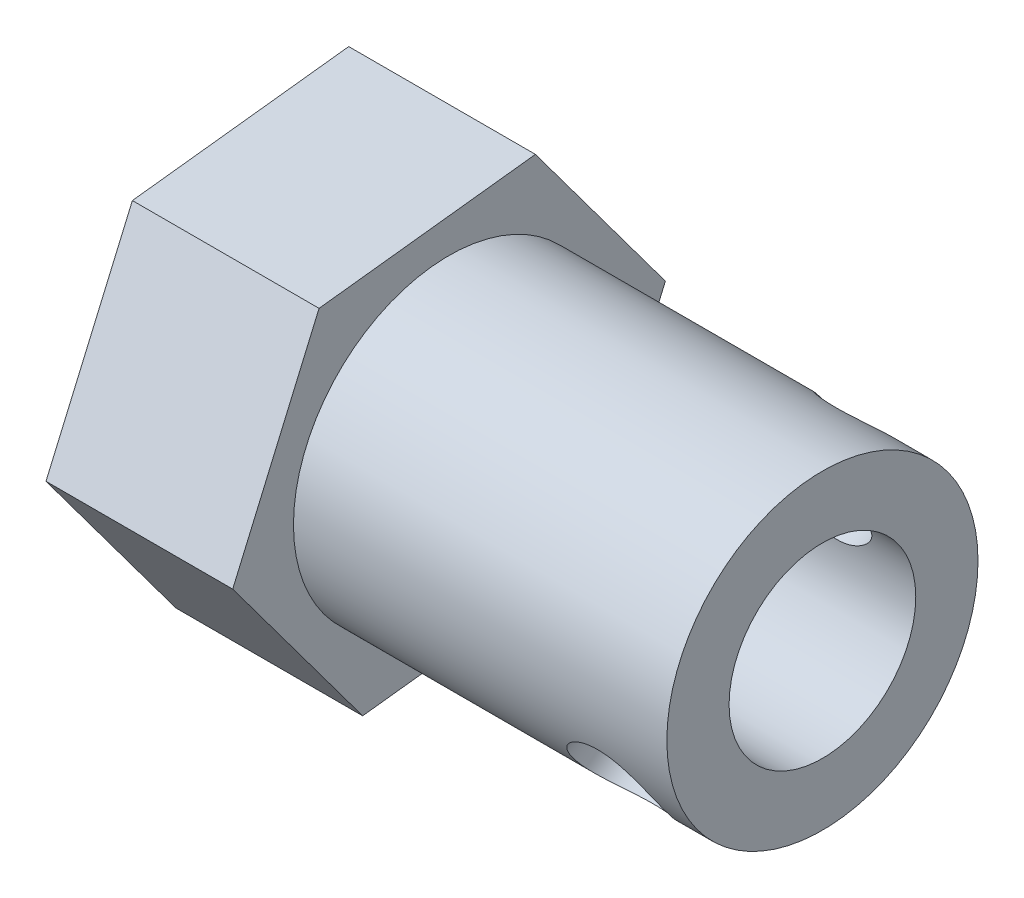
ISO-10303-21;
HEADER;
FILE_DESCRIPTION(('STEP AP214'),'2;1');
FILE_NAME('part.step','',(''),(''),'','','');
FILE_SCHEMA(('AUTOMOTIVE_DESIGN { 1 0 10303 214 1 1 1 1 }'));
ENDSEC;
DATA;
#1=APPLICATION_CONTEXT('core data for automotive mechanical design processes');
#2=APPLICATION_PROTOCOL_DEFINITION('international standard','automotive_design',2000,#1);
#3=PRODUCT_CONTEXT('',#1,'mechanical');
#4=PRODUCT('Part','Part','',(#3));
#5=PRODUCT_RELATED_PRODUCT_CATEGORY('part','',(#4));
#6=PRODUCT_DEFINITION_FORMATION('','',#4);
#7=PRODUCT_DEFINITION_CONTEXT('part definition',#1,'design');
#8=PRODUCT_DEFINITION('design','',#6,#7);
#9=PRODUCT_DEFINITION_SHAPE('','',#8);
#10=(LENGTH_UNIT() NAMED_UNIT(*) SI_UNIT(.MILLI.,.METRE.));
#11=(NAMED_UNIT(*) PLANE_ANGLE_UNIT() SI_UNIT($,.RADIAN.));
#12=(NAMED_UNIT(*) SI_UNIT($,.STERADIAN.) SOLID_ANGLE_UNIT());
#13=UNCERTAINTY_MEASURE_WITH_UNIT(LENGTH_MEASURE(1.E-05),#10,'distance_accuracy_value','');
#14=(GEOMETRIC_REPRESENTATION_CONTEXT(3) GLOBAL_UNCERTAINTY_ASSIGNED_CONTEXT((#13)) GLOBAL_UNIT_ASSIGNED_CONTEXT((#10,
#11,#12)) REPRESENTATION_CONTEXT('',''));
#15=CARTESIAN_POINT('',(0.,0.,0.));
#16=DIRECTION('',(0.,0.,1.));
#17=DIRECTION('',(1.,0.,0.));
#18=AXIS2_PLACEMENT_3D('',#15,#16,#17);
#19=CARTESIAN_POINT('',(18.,0.,0.));
#20=DIRECTION('',(-1.,0.,0.));
#21=DIRECTION('',(0.,0.,1.));
#22=AXIS2_PLACEMENT_3D('',#19,#20,#21);
#23=CYLINDRICAL_SURFACE('',#22,5.);
#24=CARTESIAN_POINT('',(15.5,-1.64276897045138,4.7224262947898));
#25=CARTESIAN_POINT('',(15.5821945479424,-1.64277029921527,4.72242636610456));
#26=CARTESIAN_POINT('',(15.664399224144,-1.64949026929,4.72010437132334));
#27=CARTESIAN_POINT('',(15.8264052495919,-1.67601147735562,4.71075127009213));
#28=CARTESIAN_POINT('',(15.9062057865015,-1.69581708616152,4.70371859018627));
#29=CARTESIAN_POINT('',(16.0610347282717,-1.74745877834305,4.6847771010607));
#30=CARTESIAN_POINT('',(16.1360708296331,-1.77927485088612,4.67287639979002));
#31=CARTESIAN_POINT('',(16.2796219339953,-1.85350013829668,4.64393345537745));
#32=CARTESIAN_POINT('',(16.3481359586844,-1.89591093892668,4.62689044248231));
#33=CARTESIAN_POINT('',(16.4788663905774,-1.9909848074739,4.58679737556888));
#34=CARTESIAN_POINT('',(16.5408458979463,-2.04390697104558,4.56358909338704));
#35=CARTESIAN_POINT('',(16.6546379513225,-2.15718857354355,4.51114485446022));
#36=CARTESIAN_POINT('',(16.7064491904499,-2.21754896684987,4.48190812389591));
#37=CARTESIAN_POINT('',(16.7994626998333,-2.34490155148806,4.41663372695534));
#38=CARTESIAN_POINT('',(16.8404234244428,-2.41200507273306,4.38046792310991));
#39=CARTESIAN_POINT('',(16.9089872590428,-2.54936279451714,4.30197579349803));
#40=CARTESIAN_POINT('',(16.9365932498574,-2.61961631197686,4.25965079892983));
#41=CARTESIAN_POINT('',(16.9768800010905,-2.75877378293411,4.17082521501291));
#42=CARTESIAN_POINT('',(16.9899651276527,-2.82765885236247,4.12447870991703));
#43=CARTESIAN_POINT('',(17.0021173246464,-2.96380791099536,4.02775489391073));
#44=CARTESIAN_POINT('',(17.001187339402,-3.03107223771493,3.97737843183404));
#45=CARTESIAN_POINT('',(16.985607131457,-3.159855668666,3.87580043072434));
#46=CARTESIAN_POINT('',(16.9713948061901,-3.22148952002128,3.82467626300841));
#47=CARTESIAN_POINT('',(16.9303686640057,-3.33982475077338,3.72179013134275));
#48=CARTESIAN_POINT('',(16.9035540490573,-3.39652581753568,3.67002812720464));
#49=CARTESIAN_POINT('',(16.8377879765814,-3.50449922796774,3.56708830083462));
#50=CARTESIAN_POINT('',(16.7986987971927,-3.55570065075604,3.51592430445788));
#51=CARTESIAN_POINT('',(16.7096021475718,-3.65114784311557,3.41670396990461));
#52=CARTESIAN_POINT('',(16.6595920870365,-3.69539195820646,3.36864837251445));
#53=CARTESIAN_POINT('',(16.5478022492484,-3.77800584928915,3.27577267667349));
#54=CARTESIAN_POINT('',(16.4856430809703,-3.81608343168597,3.23114871218397));
#55=CARTESIAN_POINT('',(16.3524899821099,-3.88388450436276,3.14932883936936));
#56=CARTESIAN_POINT('',(16.2814951746108,-3.91360716448032,3.11213366929091));
#57=CARTESIAN_POINT('',(16.131760530751,-3.96471344031146,3.04676759257289));
#58=CARTESIAN_POINT('',(16.0529529541371,-3.98601435847181,3.01868664127966));
#59=CARTESIAN_POINT('',(15.8903927915545,-4.01967461798792,2.97372055716426));
#60=CARTESIAN_POINT('',(15.8066418284654,-4.03203687637817,2.9568317720506));
#61=CARTESIAN_POINT('',(15.6399176392607,-4.04741010711791,2.93575141333068));
#62=CARTESIAN_POINT('',(15.557031776106,-4.05075245274062,2.93111004330223));
#63=CARTESIAN_POINT('',(15.3915270999901,-4.04900659406928,2.93352152086496));
#64=CARTESIAN_POINT('',(15.3089082512692,-4.04391956989446,2.94057273148461));
#65=CARTESIAN_POINT('',(15.1485116220291,-4.02561372970866,2.96557938787108));
#66=CARTESIAN_POINT('',(15.0706638357365,-4.01260960005549,2.98324679726664));
#67=CARTESIAN_POINT('',(14.9195983091851,-3.97877248283809,3.0282266004752));
#68=CARTESIAN_POINT('',(14.8463812858594,-3.95793828647507,3.05554048346301));
#69=CARTESIAN_POINT('',(14.7044825359279,-3.90793098028824,3.11925518082458));
#70=CARTESIAN_POINT('',(14.6359752790142,-3.87854906452534,3.15588020996342));
#71=CARTESIAN_POINT('',(14.5073618938192,-3.81190035588355,3.23606688855811));
#72=CARTESIAN_POINT('',(14.4472577823872,-3.77463167546919,3.27963019793058));
#73=CARTESIAN_POINT('',(14.3348195941853,-3.69095863392287,3.37356198219399));
#74=CARTESIAN_POINT('',(14.282864371013,-3.64426257131291,3.4241252381213));
#75=CARTESIAN_POINT('',(14.1910332989722,-3.54326452361577,3.52853283353583));
#76=CARTESIAN_POINT('',(14.1511568502185,-3.4889629164494,3.5823770099185));
#77=CARTESIAN_POINT('',(14.0849999694317,-3.37411410252843,3.69073609905309));
#78=CARTESIAN_POINT('',(14.058617983841,-3.31361778583776,3.74524274364645));
#79=CARTESIAN_POINT('',(14.0199390811096,-3.1874203768548,3.85321123160134));
#80=CARTESIAN_POINT('',(14.0076381340516,-3.12172077947148,3.90667336958744));
#81=CARTESIAN_POINT('',(13.9977769559455,-2.98956451117792,4.0086410584646));
#82=CARTESIAN_POINT('',(13.9996673045922,-2.92323442810004,4.05725820197074));
#83=CARTESIAN_POINT('',(14.0168216324991,-2.78943775484173,4.15038314804355));
#84=CARTESIAN_POINT('',(14.0320848534804,-2.72197122931348,4.19489118344989));
#85=CARTESIAN_POINT('',(14.0752116613996,-2.58874983960458,4.27837514666928));
#86=CARTESIAN_POINT('',(14.102938180649,-2.52298437470569,4.31740534805401));
#87=CARTESIAN_POINT('',(14.1700819145072,-2.39447045537869,4.38998450179249));
#88=CARTESIAN_POINT('',(14.2095010502862,-2.33172249871659,4.42353255198846));
#89=CARTESIAN_POINT('',(14.30037345743,-2.20929272682858,4.48596719117016));
#90=CARTESIAN_POINT('',(14.3521714300008,-2.14977326272395,4.51467027876052));
#91=CARTESIAN_POINT('',(14.4657103883328,-2.03809646030456,4.56617479135351));
#92=CARTESIAN_POINT('',(14.5274542378981,-1.98594125058577,4.58897451160252));
#93=CARTESIAN_POINT('',(14.6613407783105,-1.88952228865807,4.62952781052553));
#94=CARTESIAN_POINT('',(14.7337385533904,-1.84554006653804,4.64711073873539));
#95=CARTESIAN_POINT('',(14.885555174161,-1.76941804472663,4.67662659471387));
#96=CARTESIAN_POINT('',(14.9649706236012,-1.73727255506927,4.68856223794391));
#97=CARTESIAN_POINT('',(15.1197404316063,-1.68916904212102,4.70609083831169));
#98=CARTESIAN_POINT('',(15.194608646931,-1.6718388206725,4.71222913894122));
#99=CARTESIAN_POINT('',(15.3463152224958,-1.64863931248333,4.72039642193846));
#100=CARTESIAN_POINT('',(15.4231531846452,-1.64276772813937,4.72242622811491));
#101=CARTESIAN_POINT('',(15.5,-1.64276897045138,4.7224262947898));
#102=B_SPLINE_CURVE_WITH_KNOTS('',3,(#24,#25,#26,#27,#28,#29,#30,#31,#32,#33,#34,#35,#36,#37,
#38,#39,#40,#41,#42,#43,#44,#45,#46,#47,#48,#49,#50,#51,#52,#53,#54,#55,#56,#57,#58,#59,#60,#61,
#62,#63,#64,#65,#66,#67,#68,#69,#70,#71,#72,#73,#74,#75,#76,#77,#78,#79,#80,#81,#82,#83,#84,#85,
#86,#87,#88,#89,#90,#91,#92,#93,#94,#95,#96,#97,#98,#99,#100,#101),.UNSPECIFIED.,.T.,.F.,(4,2,2,
2,2,2,2,2,2,2,2,2,2,2,2,2,2,2,2,2,2,2,2,2,2,2,2,2,2,2,2,2,2,2,2,2,2,2,4),(0.,0.246300165915547,
0.492682641688999,0.738656414466189,0.984667025370101,1.23773150007984,1.49082847871273,
1.74915939273644,2.00743455587877,2.25832140149557,2.5091555410144,2.7520012599088,
2.99486235890376,3.24055209335676,3.4863001659083,3.74152147023277,3.99676812491863,
4.25446238246266,4.51207250628411,4.76008080790309,5.00805439107387,5.24958594938817,
5.49115481045787,5.73920731809388,5.98731925928922,6.24479506100602,6.50225807324202,
6.75775391814325,7.01317662321682,7.2587630391122,7.50433553047754,7.74727096872218,
7.99024634491378,8.24099627054488,8.4918185262989,8.75011639669147,9.00828993963944,
9.23861153857447,9.46888695033559),.UNSPECIFIED.);
#103=CARTESIAN_POINT('',(15.5,-1.64276897045138,4.7224262947898));
#104=VERTEX_POINT('',#103);
#105=EDGE_CURVE('E182',#104,#104,#102,.T.);
#106=ORIENTED_EDGE('',*,*,#105,.T.);
#107=EDGE_LOOP('',(#106));
#108=FACE_BOUND('',#107,.T.);
#109=CARTESIAN_POINT('',(15.5,4.05001509681142,-2.93212852985669));
#110=CARTESIAN_POINT('',(15.4178054520576,4.05001478277048,-2.93212982294507));
#111=CARTESIAN_POINT('',(15.335600775856,4.04585737905846,-2.93789746127844));
#112=CARTESIAN_POINT('',(15.1735947504081,4.02926860088876,-2.96060577294483));
#113=CARTESIAN_POINT('',(15.0937942134985,4.01683446185724,-2.97755017949611));
#114=CARTESIAN_POINT('',(14.9389652717283,3.98383461505443,-3.0215576162842));
#115=CARTESIAN_POINT('',(14.8639291703669,3.9632824302676,-3.04860381496883));
#116=CARTESIAN_POINT('',(14.7203780660047,3.91420588337461,-3.11136192095928));
#117=CARTESIAN_POINT('',(14.6518640413156,3.88568032778066,-3.14707512547355));
#118=CARTESIAN_POINT('',(14.5211336094226,3.81992622713394,-3.22659174476284));
#119=CARTESIAN_POINT('',(14.4591541020537,3.78247159324638,-3.27059776888783));
#120=CARTESIAN_POINT('',(14.3453620486775,3.69964956342205,-3.36399814917024));
#121=CARTESIAN_POINT('',(14.2935508095501,3.65428115177793,-3.4133931966859));
#122=CARTESIAN_POINT('',(14.2005373001667,3.55512277646983,-3.51657771256032));
#123=CARTESIAN_POINT('',(14.1595765755572,3.50117806032178,-3.57043693211436));
#124=CARTESIAN_POINT('',(14.0910127409572,3.38648206583668,-3.67940016900551));
#125=CARTESIAN_POINT('',(14.0634067501425,3.32573225894909,-3.73450391519197));
#126=CARTESIAN_POINT('',(14.0231199989095,3.20062196809416,-3.84221742968108));
#127=CARTESIAN_POINT('',(14.0100348723473,3.13641448561348,-3.8948534488908));
#128=CARTESIAN_POINT('',(13.9978826753536,3.00460563549238,-3.99741313775145));
#129=CARTESIAN_POINT('',(13.998812660598,2.93700498367019,-4.0473373748875));
#130=CARTESIAN_POINT('',(14.014392868543,2.80266663228918,-4.14144619352424));
#131=CARTESIAN_POINT('',(14.0286051938099,2.73597001444591,-4.18576293218809));
#132=CARTESIAN_POINT('',(14.0696313359943,2.60338522978141,-4.26948902012813));
#133=CARTESIAN_POINT('',(14.0964459509427,2.53749711442918,-4.30889805842784));
#134=CARTESIAN_POINT('',(14.1622120234186,2.40784242508932,-4.38268509486111));
#135=CARTESIAN_POINT('',(14.2013012028073,2.34410949907407,-4.41699914974129));
#136=CARTESIAN_POINT('',(14.2903978524282,2.22162130280697,-4.47985997294153));
#137=CARTESIAN_POINT('',(14.3404079129635,2.16286721807398,-4.50840536990654));
#138=CARTESIAN_POINT('',(14.4521977507516,2.0501480002441,-4.5608012457899));
#139=CARTESIAN_POINT('',(14.5143569190297,1.99645478230935,-4.58442832423307));
#140=CARTESIAN_POINT('',(14.6475100178901,1.89858607122715,-4.62581905308184));
#141=CARTESIAN_POINT('',(14.7185048253892,1.8544115239763,-4.64358212085774));
#142=CARTESIAN_POINT('',(14.868239469249,1.77710452537862,-4.67371853376062));
#143=CARTESIAN_POINT('',(14.9470470458629,1.74408202047968,-4.68603856258388));
#144=CARTESIAN_POINT('',(15.1096072084455,1.69133219606558,-4.70533669243229));
#145=CARTESIAN_POINT('',(15.1933581715346,1.67160053937049,-4.71231653621206));
#146=CARTESIAN_POINT('',(15.3600823607393,1.64698819803166,-4.72097392617432));
#147=CARTESIAN_POINT('',(15.442968223894,1.64158138998633,-4.72283940647805));
#148=CARTESIAN_POINT('',(15.6084729000099,1.64439323696076,-4.72186126378488));
#149=CARTESIAN_POINT('',(15.6910917487308,1.65260998467076,-4.71901829997435));
#150=CARTESIAN_POINT('',(15.8514883779709,1.68182640547355,-4.70868208190323));
#151=CARTESIAN_POINT('',(15.9293361642635,1.70248844970298,-4.70131155471397));
#152=CARTESIAN_POINT('',(16.0804016908149,1.75530230219526,-4.68184799432053));
#153=CARTESIAN_POINT('',(16.1536187141406,1.787455884474,-4.66975423193618));
#154=CARTESIAN_POINT('',(16.2955174640721,1.86286512487097,-4.64019514205351));
#155=CARTESIAN_POINT('',(16.3640247209858,1.90639559733367,-4.62259435512527));
#156=CARTESIAN_POINT('',(16.4926381061808,2.00236860252298,-4.58183731815496));
#157=CARTESIAN_POINT('',(16.5527422176128,2.05481326808662,-4.55867973803038));
#158=CARTESIAN_POINT('',(16.6651804058147,2.16884867144185,-4.50557338475575));
#159=CARTESIAN_POINT('',(16.717135628987,2.23070988708599,-4.47540129314325));
#160=CARTESIAN_POINT('',(16.8089667010277,2.3597631740868,-4.40871695665284));
#161=CARTESIAN_POINT('',(16.8488431497815,2.42695498049362,-4.37220502678099));
#162=CARTESIAN_POINT('',(16.9150000305683,2.56377807735289,-4.29339270272585));
#163=CARTESIAN_POINT('',(16.941382016159,2.63338680616999,-4.25113866729215));
#164=CARTESIAN_POINT('',(16.9800609188904,2.77310127564768,-4.16134530760536));
#165=CARTESIAN_POINT('',(16.9923618659484,2.84320686832627,-4.1138074998145));
#166=CARTESIAN_POINT('',(17.0022230440545,2.97888893006713,-4.01658061595012));
#167=CARTESIAN_POINT('',(17.0003326954078,3.04453584781037,-3.96704488385067));
#168=CARTESIAN_POINT('',(16.9831783675009,3.17222115290468,-3.86570255202913));
#169=CARTESIAN_POINT('',(16.9679151465196,3.23425974464515,-3.81389608122244));
#170=CARTESIAN_POINT('',(16.9247883386004,3.35254626783113,-3.7103305984429));
#171=CARTESIAN_POINT('',(16.897061819351,3.40884922778671,-3.6585770507989));
#172=CARTESIAN_POINT('',(16.8299180854928,3.51533759277852,-3.55638219212415));
#173=CARTESIAN_POINT('',(16.7904989497138,3.56552199058313,-3.50594109822038));
#174=CARTESIAN_POINT('',(16.69962654257,3.66054421188822,-3.40665408661994));
#175=CARTESIAN_POINT('',(16.6478285699992,3.7051595795261,-3.35791085308892));
#176=CARTESIAN_POINT('',(16.5342896116672,3.78661985906874,-3.26577700549264));
#177=CARTESIAN_POINT('',(16.4725457621018,3.82346252583277,-3.22238793947413));
#178=CARTESIAN_POINT('',(16.3386592216895,3.89004443283488,-3.1417155406458));
#179=CARTESIAN_POINT('',(16.2662614466096,3.91953923199412,-3.10465272842648));
#180=CARTESIAN_POINT('',(16.114444825839,3.96971022905595,-3.0402429542255));
#181=CARTESIAN_POINT('',(16.0350293763988,3.99039066481424,-3.01289132426542));
#182=CARTESIAN_POINT('',(15.8802595683937,4.02101929755458,-2.97186588526383));
#183=CARTESIAN_POINT('',(15.805391353069,4.03188461201727,-2.95703482826507));
#184=CARTESIAN_POINT('',(15.6536847775042,4.04638193340869,-2.93716652777786));
#185=CARTESIAN_POINT('',(15.5768468153547,4.05001539042027,-2.93212732089908));
#186=CARTESIAN_POINT('',(15.5,4.05001509681142,-2.93212852985669));
#187=B_SPLINE_CURVE_WITH_KNOTS('',3,(#109,#110,#111,#112,#113,#114,#115,#116,#117,#118,#119,
#120,#121,#122,#123,#124,#125,#126,#127,#128,#129,#130,#131,#132,#133,#134,#135,#136,#137,#138,
#139,#140,#141,#142,#143,#144,#145,#146,#147,#148,#149,#150,#151,#152,#153,#154,#155,#156,#157,
#158,#159,#160,#161,#162,#163,#164,#165,#166,#167,#168,#169,#170,#171,#172,#173,#174,#175,#176,
#177,#178,#179,#180,#181,#182,#183,#184,#185,#186),.UNSPECIFIED.,.T.,.F.,(4,2,2,2,2,2,2,2,2,2,2,
2,2,2,2,2,2,2,2,2,2,2,2,2,2,2,2,2,2,2,2,2,2,2,2,2,2,2,4),(0.,0.246300165915542,
0.492682641689001,0.738656414466195,0.984667025370102,1.23773150007984,1.49082847871273,
1.74915939273645,2.00743455587877,2.25832140149558,2.5091555410144,2.7520012599088,
2.99486235890376,3.24055209335676,3.4863001659083,3.74152147023278,3.99676812491863,
4.25446238246266,4.51207250628411,4.76008080790309,5.00805439107387,5.24958594938816,
5.49115481045787,5.73920731809388,5.98731925928922,6.24479506100601,6.50225807324202,
6.75775391814325,7.01317662321682,7.2587630391122,7.50433553047754,7.74727096872219,
7.99024634491378,8.24099627054488,8.4918185262989,8.75011639669147,9.00828993963944,
9.23861153857447,9.46888695033559),.UNSPECIFIED.);
#188=CARTESIAN_POINT('',(15.5,4.05001509681142,-2.93212852985669));
#189=VERTEX_POINT('',#188);
#190=EDGE_CURVE('E178',#189,#189,#187,.T.);
#191=ORIENTED_EDGE('',*,*,#190,.T.);
#192=EDGE_LOOP('',(#191));
#193=FACE_BOUND('',#192,.T.);
#194=CARTESIAN_POINT('',(18.,0.,0.));
#195=DIRECTION('',(1.,0.,0.));
#196=DIRECTION('',(0.,0.,-1.));
#197=AXIS2_PLACEMENT_3D('',#194,#195,#196);
#198=CIRCLE('',#197,5.);
#199=CARTESIAN_POINT('',(18.,0.,-5.));
#200=VERTEX_POINT('',#199);
#201=EDGE_CURVE('E47',#200,#200,#198,.T.);
#202=ORIENTED_EDGE('',*,*,#201,.F.);
#203=EDGE_LOOP('',(#202));
#204=FACE_BOUND('',#203,.T.);
#205=CARTESIAN_POINT('',(6.,0.,0.));
#206=DIRECTION('',(-1.,0.,0.));
#207=DIRECTION('',(0.,0.,1.));
#208=AXIS2_PLACEMENT_3D('',#205,#206,#207);
#209=CIRCLE('',#208,5.);
#210=CARTESIAN_POINT('',(6.,0.,5.));
#211=VERTEX_POINT('',#210);
#212=EDGE_CURVE('E11',#211,#211,#209,.T.);
#213=ORIENTED_EDGE('',*,*,#212,.F.);
#214=EDGE_LOOP('',(#213));
#215=FACE_BOUND('',#214,.T.);
#216=ADVANCED_FACE('F33',(#108,#193,#204,#215),#23,.T.);
#217=CARTESIAN_POINT('',(18.,0.,0.));
#218=DIRECTION('',(-1.,0.,0.));
#219=DIRECTION('',(0.,0.,1.));
#220=AXIS2_PLACEMENT_3D('',#217,#218,#219);
#221=CYLINDRICAL_SURFACE('',#220,3.);
#222=CARTESIAN_POINT('',(15.5,-0.346820281590558,2.97988518105605));
#223=CARTESIAN_POINT('',(15.5781617122929,-0.346828722799379,2.97988738957281));
#224=CARTESIAN_POINT('',(15.6564221172876,-0.353892074644911,2.97908833860227));
#225=CARTESIAN_POINT('',(15.8105408970157,-0.381585323771733,2.97566379259017));
#226=CARTESIAN_POINT('',(15.8863938725651,-0.402243728186108,2.97303445900312));
#227=CARTESIAN_POINT('',(16.0331774965159,-0.455458313208438,2.96534472271822));
#228=CARTESIAN_POINT('',(16.1041319787104,-0.487951219420663,2.96029720465122));
#229=CARTESIAN_POINT('',(16.2401363029951,-0.562972214328329,2.94694918896967));
#230=CARTESIAN_POINT('',(16.3051858253937,-0.605500845904872,2.93864851536009));
#231=CARTESIAN_POINT('',(16.4334585928363,-0.7026031720525,2.91702212836963));
#232=CARTESIAN_POINT('',(16.4960887035103,-0.757881012969705,2.90333842625017));
#233=CARTESIAN_POINT('',(16.6121125826101,-0.875865888567804,2.86995102288071));
#234=CARTESIAN_POINT('',(16.6655017438753,-0.938576602877878,2.85024433227781));
#235=CARTESIAN_POINT('',(16.7650507267215,-1.07370329440105,2.80225514991906));
#236=CARTESIAN_POINT('',(16.8104806517893,-1.1464885357062,2.77348412890245));
#237=CARTESIAN_POINT('',(16.8877112798686,-1.29525134184175,2.70720071819451));
#238=CARTESIAN_POINT('',(16.9195205842058,-1.37122685864719,2.66969386829322));
#239=CARTESIAN_POINT('',(16.9662569919516,-1.51783230295303,2.58895378757728));
#240=CARTESIAN_POINT('',(16.9822242895333,-1.58845793243876,2.54631790936692));
#241=CARTESIAN_POINT('',(17.0002491780126,-1.72709043049983,2.45439594680983));
#242=CARTESIAN_POINT('',(17.0023151851936,-1.79509885880679,2.4051139047029));
#243=CARTESIAN_POINT('',(16.9928799890445,-1.92037305969069,2.30607686054614));
#244=CARTESIAN_POINT('',(16.9825429767182,-1.97805873025616,2.25673566652595));
#245=CARTESIAN_POINT('',(16.950678734143,-2.0878608760252,2.15555373421476));
#246=CARTESIAN_POINT('',(16.9291506665357,-2.13997693413675,2.10371280914747));
#247=CARTESIAN_POINT('',(16.8753761508653,-2.2384662999785,1.99863237145997));
#248=CARTESIAN_POINT('',(16.8429855302419,-2.28475017824807,1.94538343212415));
#249=CARTESIAN_POINT('',(16.7686048756978,-2.37040292377309,1.84005572362338));
#250=CARTESIAN_POINT('',(16.7266114050465,-2.40976930640863,1.78797738074549));
#251=CARTESIAN_POINT('',(16.6296569727005,-2.4850387300265,1.68202096972489));
#252=CARTESIAN_POINT('',(16.573845457511,-2.52026263485667,1.62843812054107));
#253=CARTESIAN_POINT('',(16.4531154126047,-2.58287084182277,1.52719632235496));
#254=CARTESIAN_POINT('',(16.3881899415889,-2.61024911984066,1.47954194121785));
#255=CARTESIAN_POINT('',(16.2460277113639,-2.65911507442412,1.38991988109648));
#256=CARTESIAN_POINT('',(16.1682709654187,-2.6801182656378,1.34850550731285));
#257=CARTESIAN_POINT('',(16.0055934929615,-2.71422351246084,1.27848454752816));
#258=CARTESIAN_POINT('',(15.9206803504737,-2.72733381549652,1.24986460047296));
#259=CARTESIAN_POINT('',(15.7531782330758,-2.74525633313137,1.20996449116616));
#260=CARTESIAN_POINT('',(15.6709383214347,-2.75064380392767,1.19748995639357));
#261=CARTESIAN_POINT('',(15.5053979877252,-2.75511201562196,1.18718042840319));
#262=CARTESIAN_POINT('',(15.4220983563203,-2.75419721148103,1.18933509405979));
#263=CARTESIAN_POINT('',(15.2665191221319,-2.74650271297132,1.20697565740996));
#264=CARTESIAN_POINT('',(15.1940308233381,-2.74037553170583,1.22097745474551));
#265=CARTESIAN_POINT('',(15.0524483205936,-2.72302116005645,1.25920330285426));
#266=CARTESIAN_POINT('',(14.9833552238801,-2.71179231800019,1.28343066399264));
#267=CARTESIAN_POINT('',(14.846883003646,-2.68340882924956,1.34179431376273));
#268=CARTESIAN_POINT('',(14.7797314747197,-2.6660038146097,1.37633756642439));
#269=CARTESIAN_POINT('',(14.6517960926915,-2.62510663508081,1.45282312331235));
#270=CARTESIAN_POINT('',(14.5910155347301,-2.601611341833,1.49476922657437));
#271=CARTESIAN_POINT('',(14.4695318487147,-2.54480016009455,1.58978753763877));
#272=CARTESIAN_POINT('',(14.4098042739235,-2.51061967394402,1.64359572864554));
#273=CARTESIAN_POINT('',(14.3008816430096,-2.43362693997363,1.75558438184282));
#274=CARTESIAN_POINT('',(14.2516901446542,-2.39081178588997,1.81376631200332));
#275=CARTESIAN_POINT('',(14.1641394110748,-2.29512886053609,1.93349452549732));
#276=CARTESIAN_POINT('',(14.1261003226836,-2.24202560411368,1.99508907489065));
#277=CARTESIAN_POINT('',(14.0642931442139,-2.12704817427302,2.11723318403221));
#278=CARTESIAN_POINT('',(14.0405125229505,-2.06518176173527,2.17778361581518));
#279=CARTESIAN_POINT('',(14.009947153738,-1.94015714234711,2.28957845741998));
#280=CARTESIAN_POINT('',(14.0018031861858,-1.8776382879691,2.3411669724385));
#281=CARTESIAN_POINT('',(13.9987351018184,-1.74839644770748,2.43919620434149));
#282=CARTESIAN_POINT('',(14.0038063572147,-1.68167494151942,2.48563871734686));
#283=CARTESIAN_POINT('',(14.0261246101934,-1.55080232857267,2.56917254421401));
#284=CARTESIAN_POINT('',(14.0425472738865,-1.48677155690616,2.6066783932279));
#285=CARTESIAN_POINT('',(14.0859904989545,-1.3590050921156,2.67551388509055));
#286=CARTESIAN_POINT('',(14.1130125801402,-1.29526944263463,2.70684264126063));
#287=CARTESIAN_POINT('',(14.178090578249,-1.16727582090258,2.76452645102217));
#288=CARTESIAN_POINT('',(14.2165689848118,-1.10311210063758,2.79061146766139));
#289=CARTESIAN_POINT('',(14.3029368962886,-0.979021985901599,2.83652969400639));
#290=CARTESIAN_POINT('',(14.3508307236735,-0.919097554868439,2.85636002135218));
#291=CARTESIAN_POINT('',(14.4601957085341,-0.799592801825004,2.89221703505733));
#292=CARTESIAN_POINT('',(14.5225437312158,-0.740640233394047,2.90766877736979));
#293=CARTESIAN_POINT('',(14.6561760816947,-0.632337347337203,2.93313018988352));
#294=CARTESIAN_POINT('',(14.7274682313015,-0.582995532100613,2.94313505528871));
#295=CARTESIAN_POINT('',(14.8799549698714,-0.495138386489574,2.95920596321727));
#296=CARTESIAN_POINT('',(14.9613912966931,-0.457014470321811,2.96513753978529));
#297=CARTESIAN_POINT('',(15.1299986065097,-0.396740437873087,2.97381037908972));
#298=CARTESIAN_POINT('',(15.217149333369,-0.374536909149205,2.97656232856685));
#299=CARTESIAN_POINT('',(15.337708033478,-0.356502280516354,2.97874486225514));
#300=CARTESIAN_POINT('',(15.3700518415968,-0.352879307053495,2.979174705898));
#301=CARTESIAN_POINT('',(15.4349247210234,-0.348036469767949,2.97974441518953));
#302=CARTESIAN_POINT('',(15.4674538045788,-0.346816766708094,2.97988426143932));
#303=CARTESIAN_POINT('',(15.5,-0.346820281590558,2.97988518105605));
#304=B_SPLINE_CURVE_WITH_KNOTS('',3,(#222,#223,#224,#225,#226,#227,#228,#229,#230,#231,#232,
#233,#234,#235,#236,#237,#238,#239,#240,#241,#242,#243,#244,#245,#246,#247,#248,#249,#250,#251,
#252,#253,#254,#255,#256,#257,#258,#259,#260,#261,#262,#263,#264,#265,#266,#267,#268,#269,#270,
#271,#272,#273,#274,#275,#276,#277,#278,#279,#280,#281,#282,#283,#284,#285,#286,#287,#288,#289,
#290,#291,#292,#293,#294,#295,#296,#297,#298,#299,#300,#301,#302,#303),.UNSPECIFIED.,.T.,.F.,(4,
2,2,2,2,2,2,2,2,2,2,2,2,2,2,2,2,2,2,2,2,2,2,2,2,2,2,2,2,2,2,2,2,2,2,2,2,2,2,2,4),(0.,
0.234348183892077,0.469189339237209,0.70279289387833,0.93640908816773,1.18929346874735,
1.44230356626556,1.71236838358145,1.98226240445837,2.23295227451903,2.4834903552906,
2.71224146226808,2.94100968776183,3.1729430209672,3.40495949025408,3.65890787185336,
3.91305072368878,4.18333262594172,4.45333161317557,4.70193436281317,4.95036139782559,
5.17161275136038,5.39293578654094,5.62450944609131,5.85620229330071,6.11710115370919,
6.37808797467303,6.64596272119448,6.91360169713157,7.1566840558423,7.39968130190957,
7.62666637307239,7.85368400268019,8.09041126079207,8.32724745151078,8.58765362775101,
8.84828914267731,9.11716123557907,9.3851269950414,9.48270202777963,9.5802835874181),.UNSPECIFIED.);
#305=CARTESIAN_POINT('',(15.5,-0.346820281590558,2.97988518105605));
#306=VERTEX_POINT('',#305);
#307=EDGE_CURVE('E37',#306,#306,#304,.T.);
#308=ORIENTED_EDGE('',*,*,#307,.F.);
#309=EDGE_LOOP('',(#308));
#310=FACE_BOUND('',#309,.T.);
#311=CARTESIAN_POINT('',(15.5,2.75406640795061,-1.18958741612294));
#312=CARTESIAN_POINT('',(15.4218382877071,2.75406609418468,-1.18959613581924));
#313=CARTESIAN_POINT('',(15.3435778827124,2.75126842143453,-1.19613084690164));
#314=CARTESIAN_POINT('',(15.1894591029843,2.74002022570385,-1.22166751965659));
#315=CARTESIAN_POINT('',(15.1136061274349,2.73155782384917,-1.24069567834075));
#316=CARTESIAN_POINT('',(14.9668225034841,2.7088812886019,-1.28944707680694));
#317=CARTESIAN_POINT('',(14.8958680212896,2.6946977015569,-1.31911342560975));
#318=CARTESIAN_POINT('',(14.7598636970049,2.6603275898139,-1.38712088562955));
#319=CARTESIAN_POINT('',(14.6948141746063,2.64014074035492,-1.42546246612732));
#320=CARTESIAN_POINT('',(14.5665414071637,2.59148866222979,-1.51223537463941));
#321=CARTESIAN_POINT('',(14.5039112964897,2.56247797309471,-1.56123806146442));
#322=CARTESIAN_POINT('',(14.3878874173899,2.49655350900488,-1.66462623587582));
#323=CARTESIAN_POINT('',(14.3344982561247,2.45963581234233,-1.71901438731462));
#324=CARTESIAN_POINT('',(14.2349492732785,2.37479470226875,-1.83461789256833));
#325=CARTESIAN_POINT('',(14.1895193482107,2.32629716795793,-1.89604632383559));
#326=CARTESIAN_POINT('',(14.1122887201314,2.2200118560374,-2.01944525209008));
#327=CARTESIAN_POINT('',(14.0804794157942,2.16222997323108,-2.08141538169079));
#328=CARTESIAN_POINT('',(14.0337430080484,2.04272014959123,-2.19858841181164));
#329=CARTESIAN_POINT('',(14.0177757104667,1.98156553502062,-2.25395907884522));
#330=CARTESIAN_POINT('',(13.9997508219874,1.85364087279303,-2.36027886775095));
#331=CARTESIAN_POINT('',(13.9976848148064,1.78687424762414,-2.41123064650861));
#332=CARTESIAN_POINT('',(14.0071200109555,1.65597914072326,-2.50270978353894));
#333=CARTESIAN_POINT('',(14.0174570232818,1.59212614456443,-2.54375835108356));
#334=CARTESIAN_POINT('',(14.049321265857,1.463628803063,-2.61980260049651));
#335=CARTESIAN_POINT('',(14.0708493334643,1.39898439885764,-2.65479782916918));
#336=CARTESIAN_POINT('',(14.1246238491347,1.27000857552442,-2.71888597599855));
#337=CARTESIAN_POINT('',(14.1570144697581,1.20569386086352,-2.747890534367));
#338=CARTESIAN_POINT('',(14.2313951243022,1.08017484451127,-2.7996137934287));
#339=CARTESIAN_POINT('',(14.2733885949535,1.01897166600528,-2.82233023724104));
#340=CARTESIAN_POINT('',(14.3703430272995,0.895838242104379,-2.86392839929865));
#341=CARTESIAN_POINT('',(14.426154542489,0.834386145584283,-2.88224464977264));
#342=CARTESIAN_POINT('',(14.5468845873953,0.719411095025042,-2.91307364632404));
#343=CARTESIAN_POINT('',(14.6118100584111,0.665894249053259,-2.92558193741509));
#344=CARTESIAN_POINT('',(14.7539722886361,0.566001725757253,-2.94659333830386));
#345=CARTESIAN_POINT('',(14.8317290345813,0.520295359653717,-2.95479166097735));
#346=CARTESIAN_POINT('',(14.9944065070385,0.443422231767221,-2.96730664715296));
#347=CARTESIAN_POINT('',(15.0793196495263,0.412240300870162,-2.9716273647624));
#348=CARTESIAN_POINT('',(15.2468217669242,0.36887059412204,-2.9773110165505));
#349=CARTESIAN_POINT('',(15.3290616785653,0.355373433073414,-2.97888120857727));
#350=CARTESIAN_POINT('',(15.4946020122748,0.34421422540765,-2.98019397946427));
#351=CARTESIAN_POINT('',(15.5779016436797,0.346540993134285,-2.97993784931324));
#352=CARTESIAN_POINT('',(15.7334808778681,0.365649528801081,-2.97764467524696));
#353=CARTESIAN_POINT('',(15.8059691766619,0.380822206819417,-2.97580551222051));
#354=CARTESIAN_POINT('',(15.9475516794064,0.422424980898312,-2.9701842251866));
#355=CARTESIAN_POINT('',(16.0166447761199,0.448858722576739,-2.96640147188613));
#356=CARTESIAN_POINT('',(16.153116996354,0.512921164238559,-2.95601197639939));
#357=CARTESIAN_POINT('',(16.2202685252803,0.551011658142449,-2.94928255493698));
#358=CARTESIAN_POINT('',(16.3482039073085,0.636030300967343,-2.93212300721299));
#359=CARTESIAN_POINT('',(16.4089844652699,0.682962988413084,-2.92169097803408));
#360=CARTESIAN_POINT('',(16.5304681512853,0.790309712607871,-2.89462308907506));
#361=CARTESIAN_POINT('',(16.5901957260765,0.85167738666447,-2.87737096938525));
#362=CARTESIAN_POINT('',(16.6991183569904,0.981083805797855,-2.83585810130498));
#363=CARTESIAN_POINT('',(16.7483098553458,1.04912479301256,-2.81159499195649));
#364=CARTESIAN_POINT('',(16.8358605889252,1.19132138521742,-2.75440936022906));
#365=CARTESIAN_POINT('',(16.8738996773164,1.26559097371623,-2.72127519988283));
#366=CARTESIAN_POINT('',(16.9357068557861,1.41565310673801,-2.64630621293689));
#367=CARTESIAN_POINT('',(16.9594874770495,1.4914442532934,-2.60447906991689));
#368=CARTESIAN_POINT('',(16.990052846262,1.63448579393078,-2.51690989888804));
#369=CARTESIAN_POINT('',(16.9981968138142,1.70188177258013,-2.47187919717852));
#370=CARTESIAN_POINT('',(17.0012648981816,1.83295334132309,-2.37631023020198));
#371=CARTESIAN_POINT('',(16.9961936427853,1.8966302258077,-2.32577389886909));
#372=CARTESIAN_POINT('',(16.9738753898066,2.01428866475526,-2.22447220690392));
#373=CARTESIAN_POINT('',(16.9574527261135,2.06863259765083,-2.17394137089359));
#374=CARTESIAN_POINT('',(16.9140095010455,2.17132055336548,-2.0713851511105));
#375=CARTESIAN_POINT('',(16.8869874198598,2.21966371444711,-2.01935955400138));
#376=CARTESIAN_POINT('',(16.821909421751,2.31173697396648,-1.91337698942507));
#377=CARTESIAN_POINT('',(16.7834310151882,2.35518133562473,-1.85943258719998));
#378=CARTESIAN_POINT('',(16.6970631037114,2.4348633997292,-1.75380300447852));
#379=CARTESIAN_POINT('',(16.6491692763265,2.47109777675402,-1.70211887501006));
#380=CARTESIAN_POINT('',(16.5398042914659,2.53982473802311,-1.59798570917641));
#381=CARTESIAN_POINT('',(16.4774562687842,2.57158606321963,-1.54597244272583));
#382=CARTESIAN_POINT('',(16.3438239183053,2.62713383597482,-1.44957615857871));
#383=CARTESIAN_POINT('',(16.2725317686985,2.65091323545551,-1.40519990115477));
#384=CARTESIAN_POINT('',(16.1200450301286,2.69158456887411,-1.32568264042151));
#385=CARTESIAN_POINT('',(16.0386087033069,2.70823509778605,-1.2908778063966));
#386=CARTESIAN_POINT('',(15.8700013934903,2.73388445049784,-1.23564839543924));
#387=CARTESIAN_POINT('',(15.782850666631,2.74290887802078,-1.21517573997885));
#388=CARTESIAN_POINT('',(15.662291966522,2.7501884083782,-1.19853183055225));
#389=CARTESIAN_POINT('',(15.6299481584032,2.75164255073807,-1.19518576237196));
#390=CARTESIAN_POINT('',(15.5650752789766,2.7535816482679,-1.19071166554457));
#391=CARTESIAN_POINT('',(15.5325461954212,2.75406653860137,-1.1895837852795));
#392=CARTESIAN_POINT('',(15.5,2.75406640795061,-1.18958741612294));
#393=B_SPLINE_CURVE_WITH_KNOTS('',3,(#311,#312,#313,#314,#315,#316,#317,#318,#319,#320,#321,
#322,#323,#324,#325,#326,#327,#328,#329,#330,#331,#332,#333,#334,#335,#336,#337,#338,#339,#340,
#341,#342,#343,#344,#345,#346,#347,#348,#349,#350,#351,#352,#353,#354,#355,#356,#357,#358,#359,
#360,#361,#362,#363,#364,#365,#366,#367,#368,#369,#370,#371,#372,#373,#374,#375,#376,#377,#378,
#379,#380,#381,#382,#383,#384,#385,#386,#387,#388,#389,#390,#391,#392),.UNSPECIFIED.,.T.,.F.,(4,
2,2,2,2,2,2,2,2,2,2,2,2,2,2,2,2,2,2,2,2,2,2,2,2,2,2,2,2,2,2,2,2,2,2,2,2,2,2,2,4),(0.,
0.234348183892073,0.469189339237207,0.702792893878329,0.936409088167724,1.18929346874735,
1.44230356626556,1.71236838358145,1.98226240445836,2.23295227451903,2.4834903552906,
2.71224146226807,2.94100968776183,3.1729430209672,3.40495949025408,3.65890787185336,
3.91305072368878,4.18333262594172,4.45333161317557,4.70193436281318,4.95036139782559,
5.17161275136038,5.39293578654094,5.62450944609131,5.85620229330071,6.1171011537092,
6.37808797467303,6.64596272119448,6.91360169713157,7.1566840558423,7.39968130190957,
7.62666637307238,7.85368400268019,8.09041126079208,8.32724745151078,8.58765362775101,
8.84828914267731,9.11716123557908,9.3851269950414,9.48270202777964,9.5802835874181),.UNSPECIFIED.);
#394=CARTESIAN_POINT('',(15.5,2.75406640795061,-1.18958741612294));
#395=VERTEX_POINT('',#394);
#396=EDGE_CURVE('E157',#395,#395,#393,.T.);
#397=ORIENTED_EDGE('',*,*,#396,.F.);
#398=EDGE_LOOP('',(#397));
#399=FACE_BOUND('',#398,.T.);
#400=CARTESIAN_POINT('',(18.,0.,0.));
#401=DIRECTION('',(1.,0.,0.));
#402=DIRECTION('',(0.,0.,-1.));
#403=AXIS2_PLACEMENT_3D('',#400,#401,#402);
#404=CIRCLE('',#403,3.);
#405=CARTESIAN_POINT('',(18.,0.,-3.));
#406=VERTEX_POINT('',#405);
#407=EDGE_CURVE('E151',#406,#406,#404,.T.);
#408=ORIENTED_EDGE('',*,*,#407,.T.);
#409=EDGE_LOOP('',(#408));
#410=FACE_BOUND('',#409,.T.);
#411=CARTESIAN_POINT('',(6.,0.,0.));
#412=DIRECTION('',(-1.,0.,0.));
#413=DIRECTION('',(0.,0.,1.));
#414=AXIS2_PLACEMENT_3D('',#411,#412,#413);
#415=CIRCLE('',#414,3.);
#416=CARTESIAN_POINT('',(6.,0.,3.));
#417=VERTEX_POINT('',#416);
#418=EDGE_CURVE('E145',#417,#417,#415,.T.);
#419=ORIENTED_EDGE('',*,*,#418,.T.);
#420=EDGE_LOOP('',(#419));
#421=FACE_BOUND('',#420,.T.);
#422=ADVANCED_FACE('F161',(#310,#399,#410,#421),#221,.F.);
#423=CARTESIAN_POINT('',(18.,0.,0.));
#424=DIRECTION('',(1.,0.,0.));
#425=DIRECTION('',(0.,0.,-1.));
#426=AXIS2_PLACEMENT_3D('',#423,#424,#425);
#427=PLANE('',#426);
#428=ORIENTED_EDGE('',*,*,#201,.T.);
#429=EDGE_LOOP('',(#428));
#430=FACE_BOUND('',#429,.T.);
#431=ORIENTED_EDGE('',*,*,#407,.F.);
#432=EDGE_LOOP('',(#431));
#433=FACE_BOUND('',#432,.T.);
#434=ADVANCED_FACE('F212',(#430,#433),#427,.T.);
#435=CARTESIAN_POINT('',(6.,0.,0.));
#436=DIRECTION('',(-1.,0.,0.));
#437=DIRECTION('',(0.,0.,1.));
#438=AXIS2_PLACEMENT_3D('',#435,#436,#437);
#439=PLANE('',#438);
#440=CARTESIAN_POINT('',(6.,0.,0.));
#441=DIRECTION('',(-1.,0.,0.));
#442=DIRECTION('',(0.,0.,1.));
#443=AXIS2_PLACEMENT_3D('',#440,#441,#442);
#444=CIRCLE('',#443,2.);
#445=CARTESIAN_POINT('',(6.,0.,2.));
#446=VERTEX_POINT('',#445);
#447=EDGE_CURVE('E131',#446,#446,#444,.T.);
#448=ORIENTED_EDGE('',*,*,#447,.T.);
#449=EDGE_LOOP('',(#448));
#450=FACE_BOUND('',#449,.T.);
#451=ORIENTED_EDGE('',*,*,#418,.F.);
#452=EDGE_LOOP('',(#451));
#453=FACE_BOUND('',#452,.T.);
#454=ADVANCED_FACE('F205',(#450,#453),#439,.F.);
#455=CARTESIAN_POINT('',(6.,6.42615495188475,-2.77570397095351));
#456=DIRECTION('',(0.,0.596765921644372,-0.802415375453352));
#457=DIRECTION('',(0.,0.802415375453352,0.596765921644372));
#458=AXIS2_PLACEMENT_3D('',#455,#456,#457);
#459=PLANE('',#458);
#460=DIRECTION('',(0.,-0.802415375453352,-0.596765921644372));
#461=VECTOR('',#460,1.);
#462=CARTESIAN_POINT('',(0.,6.42615495188475,-2.77570397095351));
#463=LINE('',#462,#461);
#464=CARTESIAN_POINT('',(0.,6.42615495188475,-2.77570397095351));
#465=VERTEX_POINT('',#464);
#466=CARTESIAN_POINT('',(0.,0.80924732371129,-6.95306542246412));
#467=VERTEX_POINT('',#466);
#468=EDGE_CURVE('E127',#465,#467,#463,.T.);
#469=ORIENTED_EDGE('',*,*,#468,.F.);
#470=DIRECTION('',(-1.,0.,0.));
#471=VECTOR('',#470,1.);
#472=CARTESIAN_POINT('',(6.,6.42615495188475,-2.77570397095351));
#473=LINE('',#472,#471);
#474=CARTESIAN_POINT('',(6.,6.42615495188475,-2.77570397095351));
#475=VERTEX_POINT('',#474);
#476=EDGE_CURVE('E56',#475,#465,#473,.T.);
#477=ORIENTED_EDGE('',*,*,#476,.F.);
#478=DIRECTION('',(0.,-0.802415375453352,-0.596765921644372));
#479=VECTOR('',#478,1.);
#480=CARTESIAN_POINT('',(6.,6.42615495188475,-2.77570397095351));
#481=LINE('',#480,#479);
#482=CARTESIAN_POINT('',(6.,0.80924732371129,-6.95306542246412));
#483=VERTEX_POINT('',#482);
#484=EDGE_CURVE('E143',#475,#483,#481,.T.);
#485=ORIENTED_EDGE('',*,*,#484,.T.);
#486=DIRECTION('',(-1.,0.,0.));
#487=VECTOR('',#486,1.);
#488=CARTESIAN_POINT('',(6.,0.80924732371129,-6.95306542246412));
#489=LINE('',#488,#487);
#490=EDGE_CURVE('E91',#483,#467,#489,.T.);
#491=ORIENTED_EDGE('',*,*,#490,.T.);
#492=EDGE_LOOP('',(#469,#477,#485,#491));
#493=FACE_BOUND('',#492,.T.);
#494=ADVANCED_FACE('F194',(#493),#459,.T.);
#495=CARTESIAN_POINT('',(6.,5.61690762817346,4.1773614515106));
#496=DIRECTION('',(0.,0.993295060352017,0.115606760530184));
#497=DIRECTION('',(0.,-0.115606760530184,0.993295060352017));
#498=AXIS2_PLACEMENT_3D('',#495,#496,#497);
#499=PLANE('',#498);
#500=DIRECTION('',(0.,0.115606760530184,-0.993295060352017));
#501=VECTOR('',#500,1.);
#502=CARTESIAN_POINT('',(0.,5.61690762817346,4.1773614515106));
#503=LINE('',#502,#501);
#504=CARTESIAN_POINT('',(0.,5.61690762817346,4.1773614515106));
#505=VERTEX_POINT('',#504);
#506=EDGE_CURVE('E140',#505,#465,#503,.T.);
#507=ORIENTED_EDGE('',*,*,#506,.F.);
#508=DIRECTION('',(-1.,0.,0.));
#509=VECTOR('',#508,1.);
#510=CARTESIAN_POINT('',(6.,5.61690762817346,4.1773614515106));
#511=LINE('',#510,#509);
#512=CARTESIAN_POINT('',(6.,5.61690762817346,4.1773614515106));
#513=VERTEX_POINT('',#512);
#514=EDGE_CURVE('E79',#513,#505,#511,.T.);
#515=ORIENTED_EDGE('',*,*,#514,.F.);
#516=DIRECTION('',(0.,0.115606760530184,-0.993295060352017));
#517=VECTOR('',#516,1.);
#518=CARTESIAN_POINT('',(6.,5.61690762817346,4.1773614515106));
#519=LINE('',#518,#517);
#520=EDGE_CURVE('E117',#513,#475,#519,.T.);
#521=ORIENTED_EDGE('',*,*,#520,.T.);
#522=ORIENTED_EDGE('',*,*,#476,.T.);
#523=EDGE_LOOP('',(#507,#515,#521,#522));
#524=FACE_BOUND('',#523,.T.);
#525=ADVANCED_FACE('F197',(#524),#499,.T.);
#526=CARTESIAN_POINT('',(6.,-0.809247323711291,6.95306542246412));
#527=DIRECTION('',(0.,0.396529138707645,0.918022135983536));
#528=DIRECTION('',(0.,-0.918022135983536,0.396529138707645));
#529=AXIS2_PLACEMENT_3D('',#526,#527,#528);
#530=PLANE('',#529);
#531=DIRECTION('',(0.,0.918022135983536,-0.396529138707645));
#532=VECTOR('',#531,1.);
#533=CARTESIAN_POINT('',(0.,-0.809247323711291,6.95306542246412));
#534=LINE('',#533,#532);
#535=CARTESIAN_POINT('',(0.,-0.809247323711291,6.95306542246412));
#536=VERTEX_POINT('',#535);
#537=EDGE_CURVE('E104',#536,#505,#534,.T.);
#538=ORIENTED_EDGE('',*,*,#537,.F.);
#539=DIRECTION('',(-1.,0.,0.));
#540=VECTOR('',#539,1.);
#541=CARTESIAN_POINT('',(6.,-0.809247323711291,6.95306542246412));
#542=LINE('',#541,#540);
#543=CARTESIAN_POINT('',(6.,-0.809247323711291,6.95306542246412));
#544=VERTEX_POINT('',#543);
#545=EDGE_CURVE('E99',#544,#536,#542,.T.);
#546=ORIENTED_EDGE('',*,*,#545,.F.);
#547=DIRECTION('',(0.,0.918022135983536,-0.396529138707645));
#548=VECTOR('',#547,1.);
#549=CARTESIAN_POINT('',(6.,-0.809247323711291,6.95306542246412));
#550=LINE('',#549,#548);
#551=EDGE_CURVE('E102',#544,#513,#550,.T.);
#552=ORIENTED_EDGE('',*,*,#551,.T.);
#553=ORIENTED_EDGE('',*,*,#514,.T.);
#554=EDGE_LOOP('',(#538,#546,#552,#553));
#555=FACE_BOUND('',#554,.T.);
#556=ADVANCED_FACE('F101',(#555),#530,.T.);
#557=CARTESIAN_POINT('',(6.,-6.42615495188475,2.77570397095351));
#558=DIRECTION('',(0.,-0.596765921644372,0.802415375453352));
#559=DIRECTION('',(0.,-0.802415375453352,-0.596765921644372));
#560=AXIS2_PLACEMENT_3D('',#557,#558,#559);
#561=PLANE('',#560);
#562=DIRECTION('',(0.,0.802415375453352,0.596765921644372));
#563=VECTOR('',#562,1.);
#564=CARTESIAN_POINT('',(0.,-6.42615495188475,2.77570397095351));
#565=LINE('',#564,#563);
#566=CARTESIAN_POINT('',(0.,-6.42615495188475,2.77570397095351));
#567=VERTEX_POINT('',#566);
#568=EDGE_CURVE('E137',#567,#536,#565,.T.);
#569=ORIENTED_EDGE('',*,*,#568,.F.);
#570=DIRECTION('',(-1.,0.,0.));
#571=VECTOR('',#570,1.);
#572=CARTESIAN_POINT('',(6.,-6.42615495188475,2.77570397095351));
#573=LINE('',#572,#571);
#574=CARTESIAN_POINT('',(6.,-6.42615495188475,2.77570397095351));
#575=VERTEX_POINT('',#574);
#576=EDGE_CURVE('E109',#575,#567,#573,.T.);
#577=ORIENTED_EDGE('',*,*,#576,.F.);
#578=DIRECTION('',(0.,0.802415375453352,0.596765921644372));
#579=VECTOR('',#578,1.);
#580=CARTESIAN_POINT('',(6.,-6.42615495188475,2.77570397095351));
#581=LINE('',#580,#579);
#582=EDGE_CURVE('E115',#575,#544,#581,.T.);
#583=ORIENTED_EDGE('',*,*,#582,.T.);
#584=ORIENTED_EDGE('',*,*,#545,.T.);
#585=EDGE_LOOP('',(#569,#577,#583,#584));
#586=FACE_BOUND('',#585,.T.);
#587=ADVANCED_FACE('F119',(#586),#561,.T.);
#588=CARTESIAN_POINT('',(6.,-5.61690762817346,-4.1773614515106));
#589=DIRECTION('',(0.,-0.993295060352017,-0.115606760530184));
#590=DIRECTION('',(0.,0.115606760530184,-0.993295060352017));
#591=AXIS2_PLACEMENT_3D('',#588,#589,#590);
#592=PLANE('',#591);
#593=DIRECTION('',(0.,-0.115606760530184,0.993295060352017));
#594=VECTOR('',#593,1.);
#595=CARTESIAN_POINT('',(0.,-5.61690762817346,-4.1773614515106));
#596=LINE('',#595,#594);
#597=CARTESIAN_POINT('',(0.,-5.61690762817346,-4.1773614515106));
#598=VERTEX_POINT('',#597);
#599=EDGE_CURVE('E134',#598,#567,#596,.T.);
#600=ORIENTED_EDGE('',*,*,#599,.F.);
#601=DIRECTION('',(-1.,0.,0.));
#602=VECTOR('',#601,1.);
#603=CARTESIAN_POINT('',(6.,-5.61690762817346,-4.1773614515106));
#604=LINE('',#603,#602);
#605=CARTESIAN_POINT('',(6.,-5.61690762817346,-4.1773614515106));
#606=VERTEX_POINT('',#605);
#607=EDGE_CURVE('E148',#606,#598,#604,.T.);
#608=ORIENTED_EDGE('',*,*,#607,.F.);
#609=DIRECTION('',(0.,-0.115606760530184,0.993295060352017));
#610=VECTOR('',#609,1.);
#611=CARTESIAN_POINT('',(6.,-5.61690762817346,-4.1773614515106));
#612=LINE('',#611,#610);
#613=EDGE_CURVE('E120',#606,#575,#612,.T.);
#614=ORIENTED_EDGE('',*,*,#613,.T.);
#615=ORIENTED_EDGE('',*,*,#576,.T.);
#616=EDGE_LOOP('',(#600,#608,#614,#615));
#617=FACE_BOUND('',#616,.T.);
#618=ADVANCED_FACE('F228',(#617),#592,.T.);
#619=CARTESIAN_POINT('',(6.,0.80924732371129,-6.95306542246412));
#620=DIRECTION('',(0.,-0.396529138707645,-0.918022135983536));
#621=DIRECTION('',(0.,0.918022135983536,-0.396529138707645));
#622=AXIS2_PLACEMENT_3D('',#619,#620,#621);
#623=PLANE('',#622);
#624=DIRECTION('',(0.,-0.918022135983536,0.396529138707645));
#625=VECTOR('',#624,1.);
#626=CARTESIAN_POINT('',(0.,0.80924732371129,-6.95306542246412));
#627=LINE('',#626,#625);
#628=EDGE_CURVE('E130',#467,#598,#627,.T.);
#629=ORIENTED_EDGE('',*,*,#628,.F.);
#630=ORIENTED_EDGE('',*,*,#490,.F.);
#631=DIRECTION('',(0.,-0.918022135983536,0.396529138707645));
#632=VECTOR('',#631,1.);
#633=CARTESIAN_POINT('',(6.,0.80924732371129,-6.95306542246412));
#634=LINE('',#633,#632);
#635=EDGE_CURVE('E122',#483,#606,#634,.T.);
#636=ORIENTED_EDGE('',*,*,#635,.T.);
#637=ORIENTED_EDGE('',*,*,#607,.T.);
#638=EDGE_LOOP('',(#629,#630,#636,#637));
#639=FACE_BOUND('',#638,.T.);
#640=ADVANCED_FACE('F192',(#639),#623,.T.);
#641=ORIENTED_EDGE('',*,*,#212,.T.);
#642=EDGE_LOOP('',(#641));
#643=FACE_BOUND('',#642,.T.);
#644=ORIENTED_EDGE('',*,*,#484,.F.);
#645=ORIENTED_EDGE('',*,*,#520,.F.);
#646=ORIENTED_EDGE('',*,*,#551,.F.);
#647=ORIENTED_EDGE('',*,*,#582,.F.);
#648=ORIENTED_EDGE('',*,*,#613,.F.);
#649=ORIENTED_EDGE('',*,*,#635,.F.);
#650=EDGE_LOOP('',(#644,#645,#646,#647,#648,#649));
#651=FACE_BOUND('',#650,.T.);
#652=ADVANCED_FACE('F113',(#643,#651),#439,.F.);
#653=CARTESIAN_POINT('',(0.,0.,0.));
#654=DIRECTION('',(1.,0.,0.));
#655=DIRECTION('',(0.,0.,-1.));
#656=AXIS2_PLACEMENT_3D('',#653,#654,#655);
#657=PLANE('',#656);
#658=CARTESIAN_POINT('',(0.,0.,0.));
#659=DIRECTION('',(-1.,0.,0.));
#660=DIRECTION('',(0.,0.,1.));
#661=AXIS2_PLACEMENT_3D('',#658,#659,#660);
#662=CIRCLE('',#661,2.);
#663=CARTESIAN_POINT('',(0.,0.,2.));
#664=VERTEX_POINT('',#663);
#665=EDGE_CURVE('E187',#664,#664,#662,.T.);
#666=ORIENTED_EDGE('',*,*,#665,.F.);
#667=EDGE_LOOP('',(#666));
#668=FACE_BOUND('',#667,.T.);
#669=ORIENTED_EDGE('',*,*,#468,.T.);
#670=ORIENTED_EDGE('',*,*,#628,.T.);
#671=ORIENTED_EDGE('',*,*,#599,.T.);
#672=ORIENTED_EDGE('',*,*,#568,.T.);
#673=ORIENTED_EDGE('',*,*,#537,.T.);
#674=ORIENTED_EDGE('',*,*,#506,.T.);
#675=EDGE_LOOP('',(#669,#670,#671,#672,#673,#674));
#676=FACE_BOUND('',#675,.T.);
#677=ADVANCED_FACE('F196',(#668,#676),#657,.F.);
#678=CARTESIAN_POINT('',(6.,0.,0.));
#679=DIRECTION('',(-1.,0.,0.));
#680=DIRECTION('',(0.,0.,1.));
#681=AXIS2_PLACEMENT_3D('',#678,#679,#680);
#682=CYLINDRICAL_SURFACE('',#681,2.);
#683=ORIENTED_EDGE('',*,*,#447,.F.);
#684=EDGE_LOOP('',(#683));
#685=FACE_BOUND('',#684,.T.);
#686=ORIENTED_EDGE('',*,*,#665,.T.);
#687=EDGE_LOOP('',(#686));
#688=FACE_BOUND('',#687,.T.);
#689=ADVANCED_FACE('F171',(#685,#688),#682,.F.);
#690=CARTESIAN_POINT('',(15.5,-4.73702176522319,6.3694305596381));
#691=DIRECTION('',(0.,0.596765921644372,-0.802415375453352));
#692=DIRECTION('',(0.,0.802415375453352,0.596765921644372));
#693=AXIS2_PLACEMENT_3D('',#690,#691,#692);
#694=CYLINDRICAL_SURFACE('',#693,1.5);
#695=ORIENTED_EDGE('',*,*,#396,.T.);
#696=EDGE_LOOP('',(#695));
#697=FACE_BOUND('',#696,.T.);
#698=ORIENTED_EDGE('',*,*,#190,.F.);
#699=EDGE_LOOP('',(#698));
#700=FACE_BOUND('',#699,.T.);
#701=ADVANCED_FACE('F169',(#697,#700),#694,.F.);
#702=ORIENTED_EDGE('',*,*,#307,.T.);
#703=EDGE_LOOP('',(#702));
#704=FACE_BOUND('',#703,.T.);
#705=ORIENTED_EDGE('',*,*,#105,.F.);
#706=EDGE_LOOP('',(#705));
#707=FACE_BOUND('',#706,.T.);
#708=ADVANCED_FACE('F165',(#704,#707),#694,.F.);
#709=CLOSED_SHELL('',(#216,#422,#434,#454,#494,#525,#556,#587,#618,#640,#652,#677,#689,#701,#708));
#710=MANIFOLD_SOLID_BREP('B2',#709);
#711=ADVANCED_BREP_SHAPE_REPRESENTATION('',(#18,#710),#14);
#712=SHAPE_DEFINITION_REPRESENTATION(#9,#711);
ENDSEC;
END-ISO-10303-21;
